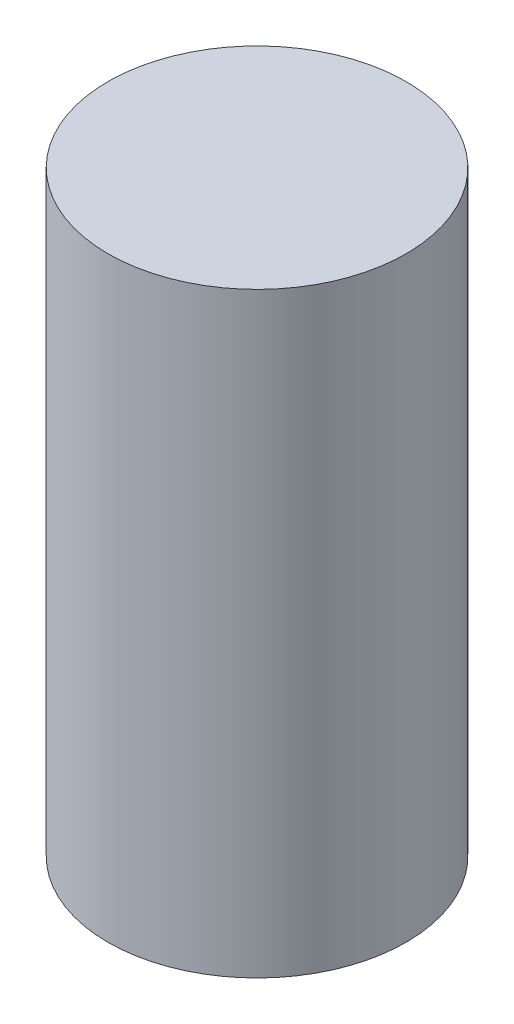
ISO-10303-21;
HEADER;
FILE_DESCRIPTION(('STEP AP214'),'2;1');
FILE_NAME('part.step','',(''),(''),'','','');
FILE_SCHEMA(('AUTOMOTIVE_DESIGN { 1 0 10303 214 1 1 1 1 }'));
ENDSEC;
DATA;
#1=APPLICATION_CONTEXT('core data for automotive mechanical design processes');
#2=APPLICATION_PROTOCOL_DEFINITION('international standard','automotive_design',2000,#1);
#3=PRODUCT_CONTEXT('',#1,'mechanical');
#4=PRODUCT('Part','Part','',(#3));
#5=PRODUCT_RELATED_PRODUCT_CATEGORY('part','',(#4));
#6=PRODUCT_DEFINITION_FORMATION('','',#4);
#7=PRODUCT_DEFINITION_CONTEXT('part definition',#1,'design');
#8=PRODUCT_DEFINITION('design','',#6,#7);
#9=PRODUCT_DEFINITION_SHAPE('','',#8);
#10=(LENGTH_UNIT() NAMED_UNIT(*) SI_UNIT(.MILLI.,.METRE.));
#11=(NAMED_UNIT(*) PLANE_ANGLE_UNIT() SI_UNIT($,.RADIAN.));
#12=(NAMED_UNIT(*) SI_UNIT($,.STERADIAN.) SOLID_ANGLE_UNIT());
#13=UNCERTAINTY_MEASURE_WITH_UNIT(LENGTH_MEASURE(1.E-05),#10,'distance_accuracy_value','');
#14=(GEOMETRIC_REPRESENTATION_CONTEXT(3) GLOBAL_UNCERTAINTY_ASSIGNED_CONTEXT((#13)) GLOBAL_UNIT_ASSIGNED_CONTEXT((#10,
#11,#12)) REPRESENTATION_CONTEXT('',''));
#15=CARTESIAN_POINT('',(0.,0.,0.));
#16=DIRECTION('',(0.,0.,1.));
#17=DIRECTION('',(1.,0.,0.));
#18=AXIS2_PLACEMENT_3D('',#15,#16,#17);
#19=CARTESIAN_POINT('',(0.,8.,0.));
#20=DIRECTION('',(0.,-1.,0.));
#21=DIRECTION('',(0.,0.,-1.));
#22=AXIS2_PLACEMENT_3D('',#19,#20,#21);
#23=CYLINDRICAL_SURFACE('',#22,2.);
#24=CARTESIAN_POINT('',(0.,8.,0.));
#25=DIRECTION('',(0.,1.,0.));
#26=DIRECTION('',(0.,0.,1.));
#27=AXIS2_PLACEMENT_3D('',#24,#25,#26);
#28=CIRCLE('',#27,2.);
#29=CARTESIAN_POINT('',(0.,8.,2.));
#30=VERTEX_POINT('',#29);
#31=EDGE_CURVE('E10',#30,#30,#28,.T.);
#32=ORIENTED_EDGE('',*,*,#31,.F.);
#33=EDGE_LOOP('',(#32));
#34=FACE_BOUND('',#33,.T.);
#35=CARTESIAN_POINT('',(0.,0.,0.));
#36=DIRECTION('',(0.,1.,0.));
#37=DIRECTION('',(0.,0.,1.));
#38=AXIS2_PLACEMENT_3D('',#35,#36,#37);
#39=CIRCLE('',#38,2.);
#40=CARTESIAN_POINT('',(0.,0.,2.));
#41=VERTEX_POINT('',#40);
#42=EDGE_CURVE('E44',#41,#41,#39,.T.);
#43=ORIENTED_EDGE('',*,*,#42,.T.);
#44=EDGE_LOOP('',(#43));
#45=FACE_BOUND('',#44,.T.);
#46=ADVANCED_FACE('F41',(#34,#45),#23,.T.);
#47=CARTESIAN_POINT('',(0.,8.,0.));
#48=DIRECTION('',(0.,1.,0.));
#49=DIRECTION('',(0.,0.,1.));
#50=AXIS2_PLACEMENT_3D('',#47,#48,#49);
#51=PLANE('',#50);
#52=ORIENTED_EDGE('',*,*,#31,.T.);
#53=EDGE_LOOP('',(#52));
#54=FACE_BOUND('',#53,.T.);
#55=ADVANCED_FACE('F58',(#54),#51,.T.);
#56=CARTESIAN_POINT('',(0.,0.,0.));
#57=DIRECTION('',(0.,1.,0.));
#58=DIRECTION('',(0.,0.,1.));
#59=AXIS2_PLACEMENT_3D('',#56,#57,#58);
#60=PLANE('',#59);
#61=ORIENTED_EDGE('',*,*,#42,.F.);
#62=EDGE_LOOP('',(#61));
#63=FACE_BOUND('',#62,.T.);
#64=ADVANCED_FACE('F56',(#63),#60,.F.);
#65=CLOSED_SHELL('',(#46,#55,#64));
#66=MANIFOLD_SOLID_BREP('B2',#65);
#67=ADVANCED_BREP_SHAPE_REPRESENTATION('',(#18,#66),#14);
#68=SHAPE_DEFINITION_REPRESENTATION(#9,#67);
ENDSEC;
END-ISO-10303-21;
